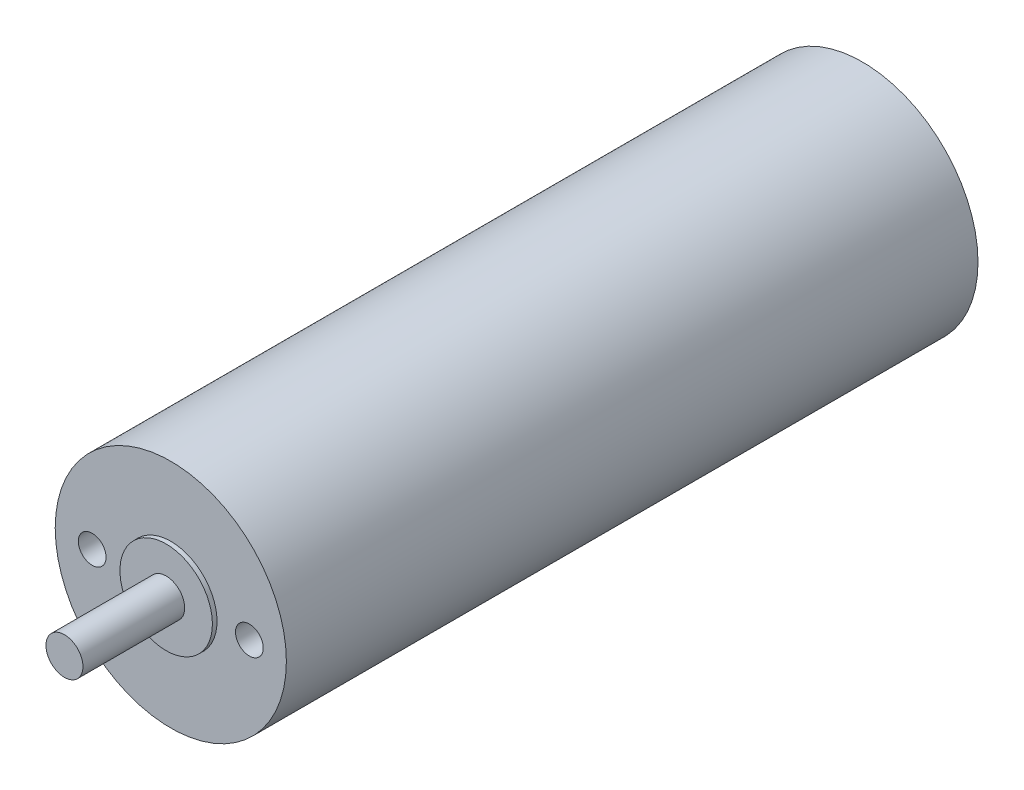
ISO-10303-21;
HEADER;
FILE_DESCRIPTION(('STEP AP214'),'2;1');
FILE_NAME('part.step','',(''),(''),'','','');
FILE_SCHEMA(('AUTOMOTIVE_DESIGN { 1 0 10303 214 1 1 1 1 }'));
ENDSEC;
DATA;
#1=APPLICATION_CONTEXT('core data for automotive mechanical design processes');
#2=APPLICATION_PROTOCOL_DEFINITION('international standard','automotive_design',2000,#1);
#3=PRODUCT_CONTEXT('',#1,'mechanical');
#4=PRODUCT('Part','Part','',(#3));
#5=PRODUCT_RELATED_PRODUCT_CATEGORY('part','',(#4));
#6=PRODUCT_DEFINITION_FORMATION('','',#4);
#7=PRODUCT_DEFINITION_CONTEXT('part definition',#1,'design');
#8=PRODUCT_DEFINITION('design','',#6,#7);
#9=PRODUCT_DEFINITION_SHAPE('','',#8);
#10=(LENGTH_UNIT() NAMED_UNIT(*) SI_UNIT(.MILLI.,.METRE.));
#11=(NAMED_UNIT(*) PLANE_ANGLE_UNIT() SI_UNIT($,.RADIAN.));
#12=(NAMED_UNIT(*) SI_UNIT($,.STERADIAN.) SOLID_ANGLE_UNIT());
#13=UNCERTAINTY_MEASURE_WITH_UNIT(LENGTH_MEASURE(1.E-05),#10,'distance_accuracy_value','');
#14=(GEOMETRIC_REPRESENTATION_CONTEXT(3) GLOBAL_UNCERTAINTY_ASSIGNED_CONTEXT((#13)) GLOBAL_UNIT_ASSIGNED_CONTEXT((#10,
#11,#12)) REPRESENTATION_CONTEXT('',''));
#15=CARTESIAN_POINT('',(0.,0.,0.));
#16=DIRECTION('',(0.,0.,1.));
#17=DIRECTION('',(1.,0.,0.));
#18=AXIS2_PLACEMENT_3D('',#15,#16,#17);
#19=CARTESIAN_POINT('',(0.,0.,74.8));
#20=DIRECTION('',(0.,0.,-1.));
#21=DIRECTION('',(-1.,0.,0.));
#22=AXIS2_PLACEMENT_3D('',#19,#20,#21);
#23=CYLINDRICAL_SURFACE('',#22,12.5);
#24=CARTESIAN_POINT('',(0.,0.,74.8));
#25=DIRECTION('',(0.,0.,1.));
#26=DIRECTION('',(1.,0.,0.));
#27=AXIS2_PLACEMENT_3D('',#24,#25,#26);
#28=CIRCLE('',#27,12.5);
#29=CARTESIAN_POINT('',(12.5,0.,74.8));
#30=VERTEX_POINT('',#29);
#31=EDGE_CURVE('E55',#30,#30,#28,.T.);
#32=ORIENTED_EDGE('',*,*,#31,.F.);
#33=EDGE_LOOP('',(#32));
#34=FACE_BOUND('',#33,.T.);
#35=CARTESIAN_POINT('',(0.,0.,0.));
#36=DIRECTION('',(0.,0.,1.));
#37=DIRECTION('',(1.,0.,0.));
#38=AXIS2_PLACEMENT_3D('',#35,#36,#37);
#39=CIRCLE('',#38,12.5);
#40=CARTESIAN_POINT('',(12.5,0.,0.));
#41=VERTEX_POINT('',#40);
#42=EDGE_CURVE('E46',#41,#41,#39,.T.);
#43=ORIENTED_EDGE('',*,*,#42,.T.);
#44=EDGE_LOOP('',(#43));
#45=FACE_BOUND('',#44,.T.);
#46=ADVANCED_FACE('F43',(#34,#45),#23,.T.);
#47=CARTESIAN_POINT('',(0.,0.,74.8));
#48=DIRECTION('',(0.,0.,1.));
#49=DIRECTION('',(1.,0.,0.));
#50=AXIS2_PLACEMENT_3D('',#47,#48,#49);
#51=PLANE('',#50);
#52=CARTESIAN_POINT('',(-8.5,0.,74.8));
#53=DIRECTION('',(0.,0.,1.));
#54=DIRECTION('',(1.,0.,0.));
#55=AXIS2_PLACEMENT_3D('',#52,#53,#54);
#56=CIRCLE('',#55,1.5);
#57=CARTESIAN_POINT('',(-7.,0.,74.8));
#58=VERTEX_POINT('',#57);
#59=EDGE_CURVE('E157',#58,#58,#56,.T.);
#60=ORIENTED_EDGE('',*,*,#59,.F.);
#61=EDGE_LOOP('',(#60));
#62=FACE_BOUND('',#61,.T.);
#63=CARTESIAN_POINT('',(8.5,0.,74.8));
#64=DIRECTION('',(0.,0.,1.));
#65=DIRECTION('',(1.,0.,0.));
#66=AXIS2_PLACEMENT_3D('',#63,#64,#65);
#67=CIRCLE('',#66,1.5);
#68=CARTESIAN_POINT('',(10.,0.,74.8));
#69=VERTEX_POINT('',#68);
#70=EDGE_CURVE('E165',#69,#69,#67,.T.);
#71=ORIENTED_EDGE('',*,*,#70,.F.);
#72=EDGE_LOOP('',(#71));
#73=FACE_BOUND('',#72,.T.);
#74=CARTESIAN_POINT('',(0.,0.,74.8));
#75=DIRECTION('',(0.,0.,1.));
#76=DIRECTION('',(1.,0.,0.));
#77=AXIS2_PLACEMENT_3D('',#74,#75,#76);
#78=CIRCLE('',#77,5.);
#79=CARTESIAN_POINT('',(5.,0.,74.8));
#80=VERTEX_POINT('',#79);
#81=EDGE_CURVE('E50',#80,#80,#78,.T.);
#82=ORIENTED_EDGE('',*,*,#81,.F.);
#83=EDGE_LOOP('',(#82));
#84=FACE_BOUND('',#83,.T.);
#85=ORIENTED_EDGE('',*,*,#31,.T.);
#86=EDGE_LOOP('',(#85));
#87=FACE_BOUND('',#86,.T.);
#88=ADVANCED_FACE('F73',(#62,#73,#84,#87),#51,.T.);
#89=CARTESIAN_POINT('',(0.,0.,0.));
#90=DIRECTION('',(0.,0.,1.));
#91=DIRECTION('',(1.,0.,0.));
#92=AXIS2_PLACEMENT_3D('',#89,#90,#91);
#93=PLANE('',#92);
#94=ORIENTED_EDGE('',*,*,#42,.F.);
#95=EDGE_LOOP('',(#94));
#96=FACE_BOUND('',#95,.T.);
#97=ADVANCED_FACE('F70',(#96),#93,.F.);
#98=CARTESIAN_POINT('',(0.,0.,75.3));
#99=DIRECTION('',(0.,0.,-1.));
#100=DIRECTION('',(-1.,0.,0.));
#101=AXIS2_PLACEMENT_3D('',#98,#99,#100);
#102=CYLINDRICAL_SURFACE('',#101,5.);
#103=CARTESIAN_POINT('',(0.,0.,75.3));
#104=DIRECTION('',(0.,0.,1.));
#105=DIRECTION('',(1.,0.,0.));
#106=AXIS2_PLACEMENT_3D('',#103,#104,#105);
#107=CIRCLE('',#106,5.);
#108=CARTESIAN_POINT('',(5.,0.,75.3));
#109=VERTEX_POINT('',#108);
#110=EDGE_CURVE('E61',#109,#109,#107,.T.);
#111=ORIENTED_EDGE('',*,*,#110,.F.);
#112=EDGE_LOOP('',(#111));
#113=FACE_BOUND('',#112,.T.);
#114=ORIENTED_EDGE('',*,*,#81,.T.);
#115=EDGE_LOOP('',(#114));
#116=FACE_BOUND('',#115,.T.);
#117=ADVANCED_FACE('F72',(#113,#116),#102,.T.);
#118=CARTESIAN_POINT('',(0.,0.,75.3));
#119=DIRECTION('',(0.,0.,1.));
#120=DIRECTION('',(1.,0.,0.));
#121=AXIS2_PLACEMENT_3D('',#118,#119,#120);
#122=PLANE('',#121);
#123=CARTESIAN_POINT('',(0.,0.,75.3));
#124=DIRECTION('',(0.,0.,1.));
#125=DIRECTION('',(1.,0.,0.));
#126=AXIS2_PLACEMENT_3D('',#123,#124,#125);
#127=CIRCLE('',#126,2.);
#128=CARTESIAN_POINT('',(2.,0.,75.3));
#129=VERTEX_POINT('',#128);
#130=EDGE_CURVE('E10',#129,#129,#127,.T.);
#131=ORIENTED_EDGE('',*,*,#130,.F.);
#132=EDGE_LOOP('',(#131));
#133=FACE_BOUND('',#132,.T.);
#134=ORIENTED_EDGE('',*,*,#110,.T.);
#135=EDGE_LOOP('',(#134));
#136=FACE_BOUND('',#135,.T.);
#137=ADVANCED_FACE('F78',(#133,#136),#122,.T.);
#138=CARTESIAN_POINT('',(0.,0.,86.3));
#139=DIRECTION('',(0.,0.,-1.));
#140=DIRECTION('',(-1.,0.,0.));
#141=AXIS2_PLACEMENT_3D('',#138,#139,#140);
#142=CYLINDRICAL_SURFACE('',#141,2.);
#143=CARTESIAN_POINT('',(0.,0.,86.3));
#144=DIRECTION('',(0.,0.,1.));
#145=DIRECTION('',(1.,0.,0.));
#146=AXIS2_PLACEMENT_3D('',#143,#144,#145);
#147=CIRCLE('',#146,2.);
#148=CARTESIAN_POINT('',(2.,0.,86.3));
#149=VERTEX_POINT('',#148);
#150=EDGE_CURVE('E59',#149,#149,#147,.T.);
#151=ORIENTED_EDGE('',*,*,#150,.F.);
#152=EDGE_LOOP('',(#151));
#153=FACE_BOUND('',#152,.T.);
#154=ORIENTED_EDGE('',*,*,#130,.T.);
#155=EDGE_LOOP('',(#154));
#156=FACE_BOUND('',#155,.T.);
#157=ADVANCED_FACE('F106',(#153,#156),#142,.T.);
#158=CARTESIAN_POINT('',(0.,0.,86.3));
#159=DIRECTION('',(0.,0.,1.));
#160=DIRECTION('',(1.,0.,0.));
#161=AXIS2_PLACEMENT_3D('',#158,#159,#160);
#162=PLANE('',#161);
#163=ORIENTED_EDGE('',*,*,#150,.T.);
#164=EDGE_LOOP('',(#163));
#165=FACE_BOUND('',#164,.T.);
#166=ADVANCED_FACE('F114',(#165),#162,.T.);
#167=CARTESIAN_POINT('',(8.5,0.,70.8));
#168=DIRECTION('',(0.,0.,1.));
#169=DIRECTION('',(1.,0.,0.));
#170=AXIS2_PLACEMENT_3D('',#167,#168,#169);
#171=CYLINDRICAL_SURFACE('',#170,1.5);
#172=CARTESIAN_POINT('',(8.5,0.,70.8));
#173=DIRECTION('',(0.,0.,1.));
#174=DIRECTION('',(1.,0.,0.));
#175=AXIS2_PLACEMENT_3D('',#172,#173,#174);
#176=CIRCLE('',#175,1.5);
#177=CARTESIAN_POINT('',(10.,0.,70.8));
#178=VERTEX_POINT('',#177);
#179=EDGE_CURVE('E161',#178,#178,#176,.T.);
#180=ORIENTED_EDGE('',*,*,#179,.F.);
#181=EDGE_LOOP('',(#180));
#182=FACE_BOUND('',#181,.T.);
#183=ORIENTED_EDGE('',*,*,#70,.T.);
#184=EDGE_LOOP('',(#183));
#185=FACE_BOUND('',#184,.T.);
#186=ADVANCED_FACE('F121',(#182,#185),#171,.F.);
#187=CARTESIAN_POINT('',(8.5,0.,70.8));
#188=DIRECTION('',(0.,0.,1.));
#189=DIRECTION('',(1.,0.,0.));
#190=AXIS2_PLACEMENT_3D('',#187,#188,#189);
#191=PLANE('',#190);
#192=ORIENTED_EDGE('',*,*,#179,.T.);
#193=EDGE_LOOP('',(#192));
#194=FACE_BOUND('',#193,.T.);
#195=ADVANCED_FACE('F128',(#194),#191,.T.);
#196=CARTESIAN_POINT('',(-8.5,0.,70.8));
#197=DIRECTION('',(0.,0.,1.));
#198=DIRECTION('',(1.,0.,0.));
#199=AXIS2_PLACEMENT_3D('',#196,#197,#198);
#200=CYLINDRICAL_SURFACE('',#199,1.5);
#201=CARTESIAN_POINT('',(-8.5,0.,70.8));
#202=DIRECTION('',(0.,0.,1.));
#203=DIRECTION('',(1.,0.,0.));
#204=AXIS2_PLACEMENT_3D('',#201,#202,#203);
#205=CIRCLE('',#204,1.5);
#206=CARTESIAN_POINT('',(-7.,0.,70.8));
#207=VERTEX_POINT('',#206);
#208=EDGE_CURVE('E156',#207,#207,#205,.T.);
#209=ORIENTED_EDGE('',*,*,#208,.F.);
#210=EDGE_LOOP('',(#209));
#211=FACE_BOUND('',#210,.T.);
#212=ORIENTED_EDGE('',*,*,#59,.T.);
#213=EDGE_LOOP('',(#212));
#214=FACE_BOUND('',#213,.T.);
#215=ADVANCED_FACE('F136',(#211,#214),#200,.F.);
#216=CARTESIAN_POINT('',(-8.5,0.,70.8));
#217=DIRECTION('',(0.,0.,1.));
#218=DIRECTION('',(1.,0.,0.));
#219=AXIS2_PLACEMENT_3D('',#216,#217,#218);
#220=PLANE('',#219);
#221=ORIENTED_EDGE('',*,*,#208,.T.);
#222=EDGE_LOOP('',(#221));
#223=FACE_BOUND('',#222,.T.);
#224=ADVANCED_FACE('F144',(#223),#220,.T.);
#225=CLOSED_SHELL('',(#46,#88,#97,#117,#137,#157,#166,#186,#195,#215,#224));
#226=MANIFOLD_SOLID_BREP('B2',#225);
#227=ADVANCED_BREP_SHAPE_REPRESENTATION('',(#18,#226),#14);
#228=SHAPE_DEFINITION_REPRESENTATION(#9,#227);
ENDSEC;
END-ISO-10303-21;
